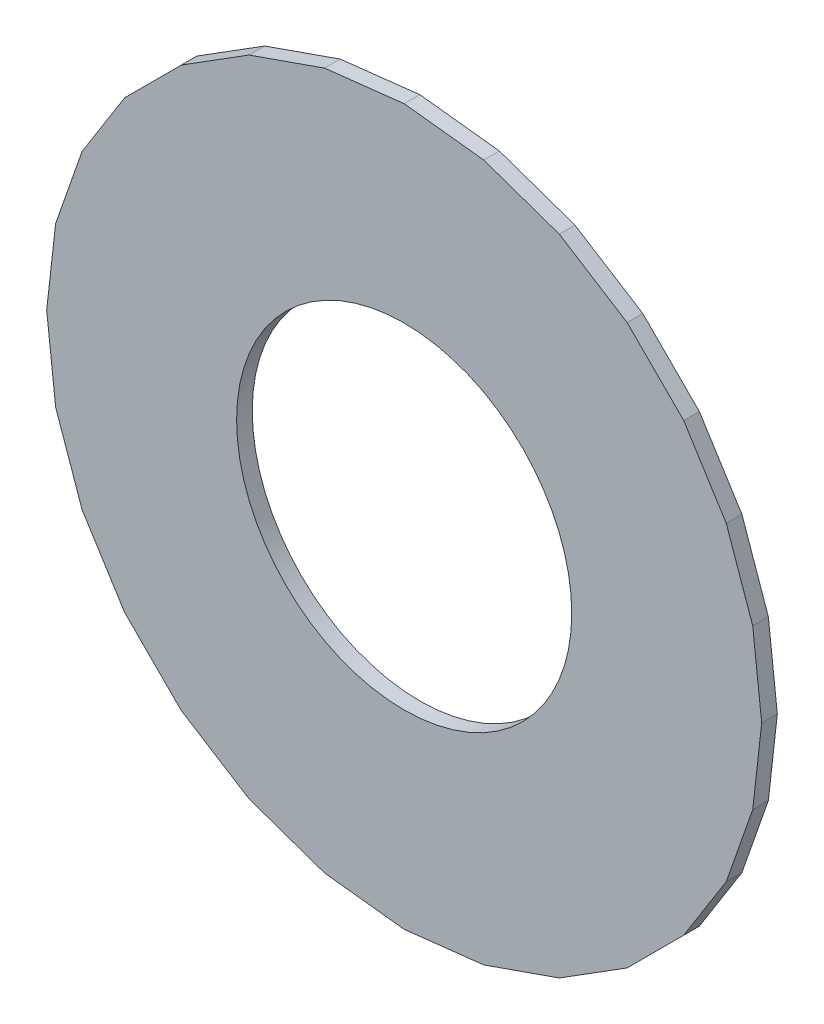
ISO-10303-21;
HEADER;
FILE_DESCRIPTION(('STEP AP214'),'2;1');
FILE_NAME('part.step','',(''),(''),'','','');
FILE_SCHEMA(('AUTOMOTIVE_DESIGN { 1 0 10303 214 1 1 1 1 }'));
ENDSEC;
DATA;
#1=APPLICATION_CONTEXT('core data for automotive mechanical design processes');
#2=APPLICATION_PROTOCOL_DEFINITION('international standard','automotive_design',2000,#1);
#3=PRODUCT_CONTEXT('',#1,'mechanical');
#4=PRODUCT('Part','Part','',(#3));
#5=PRODUCT_RELATED_PRODUCT_CATEGORY('part','',(#4));
#6=PRODUCT_DEFINITION_FORMATION('','',#4);
#7=PRODUCT_DEFINITION_CONTEXT('part definition',#1,'design');
#8=PRODUCT_DEFINITION('design','',#6,#7);
#9=PRODUCT_DEFINITION_SHAPE('','',#8);
#10=(LENGTH_UNIT() NAMED_UNIT(*) SI_UNIT(.MILLI.,.METRE.));
#11=(NAMED_UNIT(*) PLANE_ANGLE_UNIT() SI_UNIT($,.RADIAN.));
#12=(NAMED_UNIT(*) SI_UNIT($,.STERADIAN.) SOLID_ANGLE_UNIT());
#13=UNCERTAINTY_MEASURE_WITH_UNIT(LENGTH_MEASURE(1.E-05),#10,'distance_accuracy_value','');
#14=(GEOMETRIC_REPRESENTATION_CONTEXT(3) GLOBAL_UNCERTAINTY_ASSIGNED_CONTEXT((#13)) GLOBAL_UNIT_ASSIGNED_CONTEXT((#10,
#11,#12)) REPRESENTATION_CONTEXT('',''));
#15=CARTESIAN_POINT('',(0.,0.,0.));
#16=DIRECTION('',(0.,0.,1.));
#17=DIRECTION('',(1.,0.,0.));
#18=AXIS2_PLACEMENT_3D('',#15,#16,#17);
#19=CARTESIAN_POINT('',(165.608,-72.644,-0.045));
#20=DIRECTION('',(0.,0.,-1.));
#21=DIRECTION('',(0.,-1.,0.));
#22=AXIS2_PLACEMENT_3D('',#19,#20,#21);
#23=CYLINDRICAL_SURFACE('',#22,0.375);
#24=CARTESIAN_POINT('',(165.608,-72.644,-0.035));
#25=DIRECTION('',(0.,0.,-1.));
#26=DIRECTION('',(0.,-1.,0.));
#27=AXIS2_PLACEMENT_3D('',#24,#25,#26);
#28=CIRCLE('',#27,0.375);
#29=CARTESIAN_POINT('',(165.608,-73.019,-0.035));
#30=VERTEX_POINT('',#29);
#31=EDGE_CURVE('E222',#30,#30,#28,.T.);
#32=ORIENTED_EDGE('',*,*,#31,.T.);
#33=DIRECTION('',(0.,0.,1.));
#34=VECTOR('',#33,1.);
#35=CARTESIAN_POINT('',(165.608,-73.019,-0.045));
#36=LINE('',#35,#34);
#37=CARTESIAN_POINT('',(165.608,-73.019,0.));
#38=VERTEX_POINT('',#37);
#39=EDGE_CURVE('E11',#30,#38,#36,.T.);
#40=ORIENTED_EDGE('',*,*,#39,.T.);
#41=CARTESIAN_POINT('',(165.608,-72.644,0.));
#42=DIRECTION('',(0.,0.,-1.));
#43=DIRECTION('',(0.,-1.,0.));
#44=AXIS2_PLACEMENT_3D('',#41,#42,#43);
#45=CIRCLE('',#44,0.375);
#46=EDGE_CURVE('E167',#38,#38,#45,.T.);
#47=ORIENTED_EDGE('',*,*,#46,.F.);
#48=ORIENTED_EDGE('',*,*,#39,.F.);
#49=EDGE_LOOP('',(#32,#40,#47,#48));
#50=FACE_BOUND('',#49,.T.);
#51=ADVANCED_FACE('F17',(#50),#23,.F.);
#52=CARTESIAN_POINT('',(165.429983,-73.423942,-0.035));
#53=DIRECTION('',(-0.330278315977918,-0.943883591336766,0.));
#54=DIRECTION('',(-0.943883591336766,0.330278315977918,0.));
#55=AXIS2_PLACEMENT_3D('',#52,#53,#54);
#56=PLANE('',#55);
#57=DIRECTION('',(0.,0.,1.));
#58=VECTOR('',#57,1.);
#59=CARTESIAN_POINT('',(165.429983,-73.423942,-0.035));
#60=LINE('',#59,#58);
#61=CARTESIAN_POINT('',(165.429983,-73.423942,-0.035));
#62=VERTEX_POINT('',#61);
#63=CARTESIAN_POINT('',(165.429983,-73.423942,0.));
#64=VERTEX_POINT('',#63);
#65=EDGE_CURVE('E25',#62,#64,#60,.T.);
#66=ORIENTED_EDGE('',*,*,#65,.T.);
#67=DIRECTION('',(-0.943883591336766,0.330278315977918,0.));
#68=VECTOR('',#67,1.);
#69=CARTESIAN_POINT('',(165.429983,-73.423942,0.));
#70=LINE('',#69,#68);
#71=CARTESIAN_POINT('',(165.260893,-73.364775,0.));
#72=VERTEX_POINT('',#71);
#73=EDGE_CURVE('E131',#64,#72,#70,.T.);
#74=ORIENTED_EDGE('',*,*,#73,.T.);
#75=DIRECTION('',(0.,0.,1.));
#76=VECTOR('',#75,1.);
#77=CARTESIAN_POINT('',(165.260893,-73.364775,-0.035));
#78=LINE('',#77,#76);
#79=CARTESIAN_POINT('',(165.260893,-73.364775,-0.035));
#80=VERTEX_POINT('',#79);
#81=EDGE_CURVE('E136',#80,#72,#78,.T.);
#82=ORIENTED_EDGE('',*,*,#81,.F.);
#83=DIRECTION('',(-0.943883591336766,0.330278315977918,0.));
#84=VECTOR('',#83,1.);
#85=CARTESIAN_POINT('',(165.429983,-73.423942,-0.035));
#86=LINE('',#85,#84);
#87=EDGE_CURVE('E440',#62,#80,#86,.T.);
#88=ORIENTED_EDGE('',*,*,#87,.F.);
#89=EDGE_LOOP('',(#66,#74,#82,#88));
#90=FACE_BOUND('',#89,.T.);
#91=ADVANCED_FACE('F659',(#90),#56,.T.);
#92=CARTESIAN_POINT('',(165.608,-73.444,-0.035));
#93=DIRECTION('',(-0.111966136678988,-0.993712022789894,0.));
#94=DIRECTION('',(-0.993712022789894,0.111966136678988,0.));
#95=AXIS2_PLACEMENT_3D('',#92,#93,#94);
#96=PLANE('',#95);
#97=DIRECTION('',(0.,0.,1.));
#98=VECTOR('',#97,1.);
#99=CARTESIAN_POINT('',(165.608,-73.444,-0.035));
#100=LINE('',#99,#98);
#101=CARTESIAN_POINT('',(165.608,-73.444,-0.035));
#102=VERTEX_POINT('',#101);
#103=CARTESIAN_POINT('',(165.608,-73.444,0.));
#104=VERTEX_POINT('',#103);
#105=EDGE_CURVE('E132',#102,#104,#100,.T.);
#106=ORIENTED_EDGE('',*,*,#105,.T.);
#107=DIRECTION('',(-0.993712022789894,0.111966136678988,0.));
#108=VECTOR('',#107,1.);
#109=CARTESIAN_POINT('',(165.608,-73.444,0.));
#110=LINE('',#109,#108);
#111=EDGE_CURVE('E142',#104,#64,#110,.T.);
#112=ORIENTED_EDGE('',*,*,#111,.T.);
#113=ORIENTED_EDGE('',*,*,#65,.F.);
#114=DIRECTION('',(-0.993712022789894,0.111966136678988,0.));
#115=VECTOR('',#114,1.);
#116=CARTESIAN_POINT('',(165.608,-73.444,-0.035));
#117=LINE('',#116,#115);
#118=EDGE_CURVE('E436',#102,#62,#117,.T.);
#119=ORIENTED_EDGE('',*,*,#118,.F.);
#120=EDGE_LOOP('',(#106,#112,#113,#119));
#121=FACE_BOUND('',#120,.T.);
#122=ADVANCED_FACE('F664',(#121),#96,.T.);
#123=CARTESIAN_POINT('',(165.260893,-73.364775,-0.035));
#124=DIRECTION('',(-0.532032066600227,-0.846724205458361,0.));
#125=DIRECTION('',(-0.846724205458361,0.532032066600227,0.));
#126=AXIS2_PLACEMENT_3D('',#123,#124,#125);
#127=PLANE('',#126);
#128=ORIENTED_EDGE('',*,*,#81,.T.);
#129=DIRECTION('',(-0.846724205458361,0.532032066600227,0.));
#130=VECTOR('',#129,1.);
#131=CARTESIAN_POINT('',(165.260893,-73.364775,0.));
#132=LINE('',#131,#130);
#133=CARTESIAN_POINT('',(165.109208,-73.269465,0.));
#134=VERTEX_POINT('',#133);
#135=EDGE_CURVE('E127',#72,#134,#132,.T.);
#136=ORIENTED_EDGE('',*,*,#135,.T.);
#137=DIRECTION('',(0.,0.,1.));
#138=VECTOR('',#137,1.);
#139=CARTESIAN_POINT('',(165.109208,-73.269465,-0.035));
#140=LINE('',#139,#138);
#141=CARTESIAN_POINT('',(165.109208,-73.269465,-0.035));
#142=VERTEX_POINT('',#141);
#143=EDGE_CURVE('E137',#142,#134,#140,.T.);
#144=ORIENTED_EDGE('',*,*,#143,.F.);
#145=DIRECTION('',(-0.846724205458361,0.532032066600227,0.));
#146=VECTOR('',#145,1.);
#147=CARTESIAN_POINT('',(165.260893,-73.364775,-0.035));
#148=LINE('',#147,#146);
#149=EDGE_CURVE('E451',#80,#142,#148,.T.);
#150=ORIENTED_EDGE('',*,*,#149,.F.);
#151=EDGE_LOOP('',(#128,#136,#144,#150));
#152=FACE_BOUND('',#151,.T.);
#153=ADVANCED_FACE('F865',(#152),#127,.T.);
#154=CARTESIAN_POINT('',(165.786017,-73.423942,-0.035));
#155=DIRECTION('',(0.111966136678988,-0.993712022789894,0.));
#156=DIRECTION('',(0.,0.,-1.));
#157=AXIS2_PLACEMENT_3D('',#154,#155,#156);
#158=PLANE('',#157);
#159=DIRECTION('',(0.,0.,1.));
#160=VECTOR('',#159,1.);
#161=CARTESIAN_POINT('',(165.786017,-73.423942,-0.035));
#162=LINE('',#161,#160);
#163=CARTESIAN_POINT('',(165.786017,-73.423942,-0.035));
#164=VERTEX_POINT('',#163);
#165=CARTESIAN_POINT('',(165.786017,-73.423942,0.));
#166=VERTEX_POINT('',#165);
#167=EDGE_CURVE('E201',#164,#166,#162,.T.);
#168=ORIENTED_EDGE('',*,*,#167,.T.);
#169=DIRECTION('',(-0.993712022789894,-0.111966136678988,0.));
#170=VECTOR('',#169,1.);
#171=CARTESIAN_POINT('',(165.786017,-73.423942,0.));
#172=LINE('',#171,#170);
#173=EDGE_CURVE('E146',#166,#104,#172,.T.);
#174=ORIENTED_EDGE('',*,*,#173,.T.);
#175=ORIENTED_EDGE('',*,*,#105,.F.);
#176=DIRECTION('',(-0.993712022789894,-0.111966136678988,0.));
#177=VECTOR('',#176,1.);
#178=CARTESIAN_POINT('',(165.786017,-73.423942,-0.035));
#179=LINE('',#178,#177);
#180=EDGE_CURVE('E441',#164,#102,#179,.T.);
#181=ORIENTED_EDGE('',*,*,#180,.F.);
#182=EDGE_LOOP('',(#168,#174,#175,#181));
#183=FACE_BOUND('',#182,.T.);
#184=ADVANCED_FACE('F870',(#183),#158,.T.);
#185=CARTESIAN_POINT('',(165.109208,-73.269465,-0.035));
#186=DIRECTION('',(-0.707106781186548,-0.707106781186548,0.));
#187=DIRECTION('',(-0.707106781186548,0.707106781186548,0.));
#188=AXIS2_PLACEMENT_3D('',#185,#186,#187);
#189=PLANE('',#188);
#190=ORIENTED_EDGE('',*,*,#143,.T.);
#191=DIRECTION('',(-0.707106781186548,0.707106781186548,0.));
#192=VECTOR('',#191,1.);
#193=CARTESIAN_POINT('',(165.109208,-73.269465,0.));
#194=LINE('',#193,#192);
#195=CARTESIAN_POINT('',(164.982535,-73.142792,0.));
#196=VERTEX_POINT('',#195);
#197=EDGE_CURVE('E126',#134,#196,#194,.T.);
#198=ORIENTED_EDGE('',*,*,#197,.T.);
#199=DIRECTION('',(0.,0.,1.));
#200=VECTOR('',#199,1.);
#201=CARTESIAN_POINT('',(164.982535,-73.142792,-0.035));
#202=LINE('',#201,#200);
#203=CARTESIAN_POINT('',(164.982535,-73.142792,-0.035));
#204=VERTEX_POINT('',#203);
#205=EDGE_CURVE('E198',#204,#196,#202,.T.);
#206=ORIENTED_EDGE('',*,*,#205,.F.);
#207=DIRECTION('',(-0.707106781186548,0.707106781186548,0.));
#208=VECTOR('',#207,1.);
#209=CARTESIAN_POINT('',(165.109208,-73.269465,-0.035));
#210=LINE('',#209,#208);
#211=EDGE_CURVE('E455',#142,#204,#210,.T.);
#212=ORIENTED_EDGE('',*,*,#211,.F.);
#213=EDGE_LOOP('',(#190,#198,#206,#212));
#214=FACE_BOUND('',#213,.T.);
#215=ADVANCED_FACE('F509',(#214),#189,.T.);
#216=CARTESIAN_POINT('',(165.955107,-73.364775,-0.035));
#217=DIRECTION('',(0.330278315977027,-0.943883591337077,0.));
#218=DIRECTION('',(0.,0.,-1.));
#219=AXIS2_PLACEMENT_3D('',#216,#217,#218);
#220=PLANE('',#219);
#221=DIRECTION('',(0.,0.,1.));
#222=VECTOR('',#221,1.);
#223=CARTESIAN_POINT('',(165.955107,-73.364775,-0.035));
#224=LINE('',#223,#222);
#225=CARTESIAN_POINT('',(165.955107,-73.364775,-0.035));
#226=VERTEX_POINT('',#225);
#227=CARTESIAN_POINT('',(165.955107,-73.364775,0.));
#228=VERTEX_POINT('',#227);
#229=EDGE_CURVE('E194',#226,#228,#224,.T.);
#230=ORIENTED_EDGE('',*,*,#229,.T.);
#231=DIRECTION('',(-0.943883591337077,-0.330278315977027,0.));
#232=VECTOR('',#231,1.);
#233=CARTESIAN_POINT('',(165.955107,-73.364775,0.));
#234=LINE('',#233,#232);
#235=EDGE_CURVE('E150',#228,#166,#234,.T.);
#236=ORIENTED_EDGE('',*,*,#235,.T.);
#237=ORIENTED_EDGE('',*,*,#167,.F.);
#238=DIRECTION('',(-0.943883591337077,-0.330278315977027,0.));
#239=VECTOR('',#238,1.);
#240=CARTESIAN_POINT('',(165.955107,-73.364775,-0.035));
#241=LINE('',#240,#239);
#242=EDGE_CURVE('E435',#226,#164,#241,.T.);
#243=ORIENTED_EDGE('',*,*,#242,.F.);
#244=EDGE_LOOP('',(#230,#236,#237,#243));
#245=FACE_BOUND('',#244,.T.);
#246=ADVANCED_FACE('F1042',(#245),#220,.T.);
#247=CARTESIAN_POINT('',(164.982535,-73.142792,-0.035));
#248=DIRECTION('',(-0.846724205458361,-0.532032066600227,0.));
#249=DIRECTION('',(-0.532032066600227,0.846724205458361,0.));
#250=AXIS2_PLACEMENT_3D('',#247,#248,#249);
#251=PLANE('',#250);
#252=ORIENTED_EDGE('',*,*,#205,.T.);
#253=DIRECTION('',(-0.532032066600227,0.846724205458361,0.));
#254=VECTOR('',#253,1.);
#255=CARTESIAN_POINT('',(164.982535,-73.142792,0.));
#256=LINE('',#255,#254);
#257=CARTESIAN_POINT('',(164.887225,-72.991107,0.));
#258=VERTEX_POINT('',#257);
#259=EDGE_CURVE('E122',#196,#258,#256,.T.);
#260=ORIENTED_EDGE('',*,*,#259,.T.);
#261=DIRECTION('',(0.,0.,1.));
#262=VECTOR('',#261,1.);
#263=CARTESIAN_POINT('',(164.887225,-72.991107,-0.035));
#264=LINE('',#263,#262);
#265=CARTESIAN_POINT('',(164.887225,-72.991107,-0.035));
#266=VERTEX_POINT('',#265);
#267=EDGE_CURVE('E192',#266,#258,#264,.T.);
#268=ORIENTED_EDGE('',*,*,#267,.F.);
#269=DIRECTION('',(-0.532032066600227,0.846724205458361,0.));
#270=VECTOR('',#269,1.);
#271=CARTESIAN_POINT('',(164.982535,-73.142792,-0.035));
#272=LINE('',#271,#270);
#273=EDGE_CURVE('E458',#204,#266,#272,.T.);
#274=ORIENTED_EDGE('',*,*,#273,.F.);
#275=EDGE_LOOP('',(#252,#260,#268,#274));
#276=FACE_BOUND('',#275,.T.);
#277=ADVANCED_FACE('F517',(#276),#251,.T.);
#278=CARTESIAN_POINT('',(166.106792,-73.269465,-0.035));
#279=DIRECTION('',(0.532032066600227,-0.846724205458361,0.));
#280=DIRECTION('',(0.,0.,-1.));
#281=AXIS2_PLACEMENT_3D('',#278,#279,#280);
#282=PLANE('',#281);
#283=DIRECTION('',(0.,0.,1.));
#284=VECTOR('',#283,1.);
#285=CARTESIAN_POINT('',(166.106792,-73.269465,-0.035));
#286=LINE('',#285,#284);
#287=CARTESIAN_POINT('',(166.106792,-73.269465,-0.035));
#288=VERTEX_POINT('',#287);
#289=CARTESIAN_POINT('',(166.106792,-73.269465,0.));
#290=VERTEX_POINT('',#289);
#291=EDGE_CURVE('E188',#288,#290,#286,.T.);
#292=ORIENTED_EDGE('',*,*,#291,.T.);
#293=DIRECTION('',(-0.846724205458361,-0.532032066600227,0.));
#294=VECTOR('',#293,1.);
#295=CARTESIAN_POINT('',(166.106792,-73.269465,0.));
#296=LINE('',#295,#294);
#297=EDGE_CURVE('E154',#290,#228,#296,.T.);
#298=ORIENTED_EDGE('',*,*,#297,.T.);
#299=ORIENTED_EDGE('',*,*,#229,.F.);
#300=DIRECTION('',(-0.846724205458361,-0.532032066600227,0.));
#301=VECTOR('',#300,1.);
#302=CARTESIAN_POINT('',(166.106792,-73.269465,-0.035));
#303=LINE('',#302,#301);
#304=EDGE_CURVE('E431',#288,#226,#303,.T.);
#305=ORIENTED_EDGE('',*,*,#304,.F.);
#306=EDGE_LOOP('',(#292,#298,#299,#305));
#307=FACE_BOUND('',#306,.T.);
#308=ADVANCED_FACE('F1014',(#307),#282,.T.);
#309=CARTESIAN_POINT('',(164.887225,-72.991107,-0.035));
#310=DIRECTION('',(-0.943883591337077,-0.330278315977027,0.));
#311=DIRECTION('',(-0.330278315977027,0.943883591337077,0.));
#312=AXIS2_PLACEMENT_3D('',#309,#310,#311);
#313=PLANE('',#312);
#314=ORIENTED_EDGE('',*,*,#267,.T.);
#315=DIRECTION('',(-0.330278315977027,0.943883591337077,0.));
#316=VECTOR('',#315,1.);
#317=CARTESIAN_POINT('',(164.887225,-72.991107,0.));
#318=LINE('',#317,#316);
#319=CARTESIAN_POINT('',(164.828058,-72.822017,0.));
#320=VERTEX_POINT('',#319);
#321=EDGE_CURVE('E118',#258,#320,#318,.T.);
#322=ORIENTED_EDGE('',*,*,#321,.T.);
#323=DIRECTION('',(0.,0.,1.));
#324=VECTOR('',#323,1.);
#325=CARTESIAN_POINT('',(164.828058,-72.822017,-0.035));
#326=LINE('',#325,#324);
#327=CARTESIAN_POINT('',(164.828058,-72.822017,-0.035));
#328=VERTEX_POINT('',#327);
#329=EDGE_CURVE('E193',#328,#320,#326,.T.);
#330=ORIENTED_EDGE('',*,*,#329,.F.);
#331=DIRECTION('',(-0.330278315977027,0.943883591337077,0.));
#332=VECTOR('',#331,1.);
#333=CARTESIAN_POINT('',(164.887225,-72.991107,-0.035));
#334=LINE('',#333,#332);
#335=EDGE_CURVE('E463',#266,#328,#334,.T.);
#336=ORIENTED_EDGE('',*,*,#335,.F.);
#337=EDGE_LOOP('',(#314,#322,#330,#336));
#338=FACE_BOUND('',#337,.T.);
#339=ADVANCED_FACE('F1009',(#338),#313,.T.);
#340=CARTESIAN_POINT('',(166.233465,-73.142792,-0.035));
#341=DIRECTION('',(0.707106781186548,-0.707106781186548,0.));
#342=DIRECTION('',(0.,0.,-1.));
#343=AXIS2_PLACEMENT_3D('',#340,#341,#342);
#344=PLANE('',#343);
#345=DIRECTION('',(0.,0.,1.));
#346=VECTOR('',#345,1.);
#347=CARTESIAN_POINT('',(166.233465,-73.142792,-0.035));
#348=LINE('',#347,#346);
#349=CARTESIAN_POINT('',(166.233465,-73.142792,-0.035));
#350=VERTEX_POINT('',#349);
#351=CARTESIAN_POINT('',(166.233465,-73.142792,0.));
#352=VERTEX_POINT('',#351);
#353=EDGE_CURVE('E230',#350,#352,#348,.T.);
#354=ORIENTED_EDGE('',*,*,#353,.T.);
#355=DIRECTION('',(-0.707106781186548,-0.707106781186548,0.));
#356=VECTOR('',#355,1.);
#357=CARTESIAN_POINT('',(166.233465,-73.142792,0.));
#358=LINE('',#357,#356);
#359=EDGE_CURVE('E155',#352,#290,#358,.T.);
#360=ORIENTED_EDGE('',*,*,#359,.T.);
#361=ORIENTED_EDGE('',*,*,#291,.F.);
#362=DIRECTION('',(-0.707106781186548,-0.707106781186548,0.));
#363=VECTOR('',#362,1.);
#364=CARTESIAN_POINT('',(166.233465,-73.142792,-0.035));
#365=LINE('',#364,#363);
#366=EDGE_CURVE('E338',#350,#288,#365,.T.);
#367=ORIENTED_EDGE('',*,*,#366,.F.);
#368=EDGE_LOOP('',(#354,#360,#361,#367));
#369=FACE_BOUND('',#368,.T.);
#370=ADVANCED_FACE('F333',(#369),#344,.T.);
#371=CARTESIAN_POINT('',(164.828058,-72.822017,-0.035));
#372=DIRECTION('',(-0.993712022789894,-0.111966136678988,0.));
#373=DIRECTION('',(-0.111966136678988,0.993712022789894,0.));
#374=AXIS2_PLACEMENT_3D('',#371,#372,#373);
#375=PLANE('',#374);
#376=ORIENTED_EDGE('',*,*,#329,.T.);
#377=DIRECTION('',(-0.111966136678988,0.993712022789894,0.));
#378=VECTOR('',#377,1.);
#379=CARTESIAN_POINT('',(164.828058,-72.822017,0.));
#380=LINE('',#379,#378);
#381=CARTESIAN_POINT('',(164.808,-72.644,0.));
#382=VERTEX_POINT('',#381);
#383=EDGE_CURVE('E116',#320,#382,#380,.T.);
#384=ORIENTED_EDGE('',*,*,#383,.T.);
#385=DIRECTION('',(0.,0.,1.));
#386=VECTOR('',#385,1.);
#387=CARTESIAN_POINT('',(164.808,-72.644,-0.035));
#388=LINE('',#387,#386);
#389=CARTESIAN_POINT('',(164.808,-72.644,-0.035));
#390=VERTEX_POINT('',#389);
#391=EDGE_CURVE('E187',#390,#382,#388,.T.);
#392=ORIENTED_EDGE('',*,*,#391,.F.);
#393=DIRECTION('',(-0.111966136678988,0.993712022789894,0.));
#394=VECTOR('',#393,1.);
#395=CARTESIAN_POINT('',(164.828058,-72.822017,-0.035));
#396=LINE('',#395,#394);
#397=EDGE_CURVE('E467',#328,#390,#396,.T.);
#398=ORIENTED_EDGE('',*,*,#397,.F.);
#399=EDGE_LOOP('',(#376,#384,#392,#398));
#400=FACE_BOUND('',#399,.T.);
#401=ADVANCED_FACE('F263',(#400),#375,.T.);
#402=CARTESIAN_POINT('',(166.328775,-72.991107,-0.035));
#403=DIRECTION('',(0.846724205458361,-0.532032066600227,0.));
#404=DIRECTION('',(0.,0.,-1.));
#405=AXIS2_PLACEMENT_3D('',#402,#403,#404);
#406=PLANE('',#405);
#407=DIRECTION('',(0.,0.,1.));
#408=VECTOR('',#407,1.);
#409=CARTESIAN_POINT('',(166.328775,-72.991107,-0.035));
#410=LINE('',#409,#408);
#411=CARTESIAN_POINT('',(166.328775,-72.991107,-0.035));
#412=VERTEX_POINT('',#411);
#413=CARTESIAN_POINT('',(166.328775,-72.991107,0.));
#414=VERTEX_POINT('',#413);
#415=EDGE_CURVE('E184',#412,#414,#410,.T.);
#416=ORIENTED_EDGE('',*,*,#415,.T.);
#417=DIRECTION('',(-0.532032066600227,-0.846724205458361,0.));
#418=VECTOR('',#417,1.);
#419=CARTESIAN_POINT('',(166.328775,-72.991107,0.));
#420=LINE('',#419,#418);
#421=EDGE_CURVE('E159',#414,#352,#420,.T.);
#422=ORIENTED_EDGE('',*,*,#421,.T.);
#423=ORIENTED_EDGE('',*,*,#353,.F.);
#424=DIRECTION('',(-0.532032066600227,-0.846724205458361,0.));
#425=VECTOR('',#424,1.);
#426=CARTESIAN_POINT('',(166.328775,-72.991107,-0.035));
#427=LINE('',#426,#425);
#428=EDGE_CURVE('E418',#412,#350,#427,.T.);
#429=ORIENTED_EDGE('',*,*,#428,.F.);
#430=EDGE_LOOP('',(#416,#422,#423,#429));
#431=FACE_BOUND('',#430,.T.);
#432=ADVANCED_FACE('F343',(#431),#406,.T.);
#433=CARTESIAN_POINT('',(164.808,-72.644,-0.035));
#434=DIRECTION('',(-0.993712022789894,0.111966136678988,0.));
#435=DIRECTION('',(0.,0.,1.));
#436=AXIS2_PLACEMENT_3D('',#433,#434,#435);
#437=PLANE('',#436);
#438=ORIENTED_EDGE('',*,*,#391,.T.);
#439=DIRECTION('',(0.111966136678988,0.993712022789894,0.));
#440=VECTOR('',#439,1.);
#441=CARTESIAN_POINT('',(164.808,-72.644,0.));
#442=LINE('',#441,#440);
#443=CARTESIAN_POINT('',(164.828058,-72.465983,0.));
#444=VERTEX_POINT('',#443);
#445=EDGE_CURVE('E238',#382,#444,#442,.T.);
#446=ORIENTED_EDGE('',*,*,#445,.T.);
#447=DIRECTION('',(0.,0.,1.));
#448=VECTOR('',#447,1.);
#449=CARTESIAN_POINT('',(164.828058,-72.465983,-0.035));
#450=LINE('',#449,#448);
#451=CARTESIAN_POINT('',(164.828058,-72.465983,-0.035));
#452=VERTEX_POINT('',#451);
#453=EDGE_CURVE('E183',#452,#444,#450,.T.);
#454=ORIENTED_EDGE('',*,*,#453,.F.);
#455=DIRECTION('',(0.111966136678988,0.993712022789894,0.));
#456=VECTOR('',#455,1.);
#457=CARTESIAN_POINT('',(164.808,-72.644,-0.035));
#458=LINE('',#457,#456);
#459=EDGE_CURVE('E473',#390,#452,#458,.T.);
#460=ORIENTED_EDGE('',*,*,#459,.F.);
#461=EDGE_LOOP('',(#438,#446,#454,#460));
#462=FACE_BOUND('',#461,.T.);
#463=ADVANCED_FACE('F997',(#462),#437,.T.);
#464=CARTESIAN_POINT('',(166.387942,-72.822017,-0.035));
#465=DIRECTION('',(0.943883591337077,-0.330278315977027,0.));
#466=DIRECTION('',(0.,0.,-1.));
#467=AXIS2_PLACEMENT_3D('',#464,#465,#466);
#468=PLANE('',#467);
#469=DIRECTION('',(0.,0.,1.));
#470=VECTOR('',#469,1.);
#471=CARTESIAN_POINT('',(166.387942,-72.822017,-0.035));
#472=LINE('',#471,#470);
#473=CARTESIAN_POINT('',(166.387942,-72.822017,-0.035));
#474=VERTEX_POINT('',#473);
#475=CARTESIAN_POINT('',(166.387942,-72.822017,0.));
#476=VERTEX_POINT('',#475);
#477=EDGE_CURVE('E180',#474,#476,#472,.T.);
#478=ORIENTED_EDGE('',*,*,#477,.T.);
#479=DIRECTION('',(-0.330278315977027,-0.943883591337077,0.));
#480=VECTOR('',#479,1.);
#481=CARTESIAN_POINT('',(166.387942,-72.822017,0.));
#482=LINE('',#481,#480);
#483=EDGE_CURVE('E112',#476,#414,#482,.T.);
#484=ORIENTED_EDGE('',*,*,#483,.T.);
#485=ORIENTED_EDGE('',*,*,#415,.F.);
#486=DIRECTION('',(-0.330278315977027,-0.943883591337077,0.));
#487=VECTOR('',#486,1.);
#488=CARTESIAN_POINT('',(166.387942,-72.822017,-0.035));
#489=LINE('',#488,#487);
#490=EDGE_CURVE('E403',#474,#412,#489,.T.);
#491=ORIENTED_EDGE('',*,*,#490,.F.);
#492=EDGE_LOOP('',(#478,#484,#485,#491));
#493=FACE_BOUND('',#492,.T.);
#494=ADVANCED_FACE('F963',(#493),#468,.T.);
#495=CARTESIAN_POINT('',(164.828058,-72.465983,-0.035));
#496=DIRECTION('',(-0.943883591337077,0.330278315977027,0.));
#497=DIRECTION('',(0.,0.,1.));
#498=AXIS2_PLACEMENT_3D('',#495,#496,#497);
#499=PLANE('',#498);
#500=ORIENTED_EDGE('',*,*,#453,.T.);
#501=DIRECTION('',(0.330278315977027,0.943883591337077,0.));
#502=VECTOR('',#501,1.);
#503=CARTESIAN_POINT('',(164.828058,-72.465983,0.));
#504=LINE('',#503,#502);
#505=CARTESIAN_POINT('',(164.887225,-72.296893,0.));
#506=VERTEX_POINT('',#505);
#507=EDGE_CURVE('E234',#444,#506,#504,.T.);
#508=ORIENTED_EDGE('',*,*,#507,.T.);
#509=DIRECTION('',(0.,0.,1.));
#510=VECTOR('',#509,1.);
#511=CARTESIAN_POINT('',(164.887225,-72.296893,-0.035));
#512=LINE('',#511,#510);
#513=CARTESIAN_POINT('',(164.887225,-72.296893,-0.035));
#514=VERTEX_POINT('',#513);
#515=EDGE_CURVE('E179',#514,#506,#512,.T.);
#516=ORIENTED_EDGE('',*,*,#515,.F.);
#517=DIRECTION('',(0.330278315977027,0.943883591337077,0.));
#518=VECTOR('',#517,1.);
#519=CARTESIAN_POINT('',(164.828058,-72.465983,-0.035));
#520=LINE('',#519,#518);
#521=EDGE_CURVE('E428',#452,#514,#520,.T.);
#522=ORIENTED_EDGE('',*,*,#521,.F.);
#523=EDGE_LOOP('',(#500,#508,#516,#522));
#524=FACE_BOUND('',#523,.T.);
#525=ADVANCED_FACE('F281',(#524),#499,.T.);
#526=CARTESIAN_POINT('',(166.408,-72.644,-0.035));
#527=DIRECTION('',(0.993712022789894,-0.111966136678988,0.));
#528=DIRECTION('',(0.,0.,-1.));
#529=AXIS2_PLACEMENT_3D('',#526,#527,#528);
#530=PLANE('',#529);
#531=DIRECTION('',(0.,0.,1.));
#532=VECTOR('',#531,1.);
#533=CARTESIAN_POINT('',(166.408,-72.644,-0.035));
#534=LINE('',#533,#532);
#535=CARTESIAN_POINT('',(166.408,-72.644,-0.035));
#536=VERTEX_POINT('',#535);
#537=CARTESIAN_POINT('',(166.408,-72.644,0.));
#538=VERTEX_POINT('',#537);
#539=EDGE_CURVE('E141',#536,#538,#534,.T.);
#540=ORIENTED_EDGE('',*,*,#539,.T.);
#541=DIRECTION('',(-0.111966136678988,-0.993712022789894,0.));
#542=VECTOR('',#541,1.);
#543=CARTESIAN_POINT('',(166.408,-72.644,0.));
#544=LINE('',#543,#542);
#545=EDGE_CURVE('E105',#538,#476,#544,.T.);
#546=ORIENTED_EDGE('',*,*,#545,.T.);
#547=ORIENTED_EDGE('',*,*,#477,.F.);
#548=DIRECTION('',(-0.111966136678988,-0.993712022789894,0.));
#549=VECTOR('',#548,1.);
#550=CARTESIAN_POINT('',(166.408,-72.644,-0.035));
#551=LINE('',#550,#549);
#552=EDGE_CURVE('E399',#536,#474,#551,.T.);
#553=ORIENTED_EDGE('',*,*,#552,.F.);
#554=EDGE_LOOP('',(#540,#546,#547,#553));
#555=FACE_BOUND('',#554,.T.);
#556=ADVANCED_FACE('F646',(#555),#530,.T.);
#557=CARTESIAN_POINT('',(164.887225,-72.296893,-0.035));
#558=DIRECTION('',(-0.846724205458361,0.532032066600227,0.));
#559=DIRECTION('',(0.,0.,1.));
#560=AXIS2_PLACEMENT_3D('',#557,#558,#559);
#561=PLANE('',#560);
#562=ORIENTED_EDGE('',*,*,#515,.T.);
#563=DIRECTION('',(0.532032066600227,0.846724205458361,0.));
#564=VECTOR('',#563,1.);
#565=CARTESIAN_POINT('',(164.887225,-72.296893,0.));
#566=LINE('',#565,#564);
#567=CARTESIAN_POINT('',(164.982535,-72.145208,0.));
#568=VERTEX_POINT('',#567);
#569=EDGE_CURVE('E239',#506,#568,#566,.T.);
#570=ORIENTED_EDGE('',*,*,#569,.T.);
#571=DIRECTION('',(0.,0.,1.));
#572=VECTOR('',#571,1.);
#573=CARTESIAN_POINT('',(164.982535,-72.145208,-0.035));
#574=LINE('',#573,#572);
#575=CARTESIAN_POINT('',(164.982535,-72.145208,-0.035));
#576=VERTEX_POINT('',#575);
#577=EDGE_CURVE('E88',#576,#568,#574,.T.);
#578=ORIENTED_EDGE('',*,*,#577,.F.);
#579=DIRECTION('',(0.532032066600227,0.846724205458361,0.));
#580=VECTOR('',#579,1.);
#581=CARTESIAN_POINT('',(164.887225,-72.296893,-0.035));
#582=LINE('',#581,#580);
#583=EDGE_CURVE('E423',#514,#576,#582,.T.);
#584=ORIENTED_EDGE('',*,*,#583,.F.);
#585=EDGE_LOOP('',(#562,#570,#578,#584));
#586=FACE_BOUND('',#585,.T.);
#587=ADVANCED_FACE('F644',(#586),#561,.T.);
#588=CARTESIAN_POINT('',(166.387942,-72.465983,-0.035));
#589=DIRECTION('',(0.993712022789894,0.111966136678988,0.));
#590=DIRECTION('',(0.,0.,-1.));
#591=AXIS2_PLACEMENT_3D('',#588,#589,#590);
#592=PLANE('',#591);
#593=DIRECTION('',(0.,0.,1.));
#594=VECTOR('',#593,1.);
#595=CARTESIAN_POINT('',(166.387942,-72.465983,-0.035));
#596=LINE('',#595,#594);
#597=CARTESIAN_POINT('',(166.387942,-72.465983,-0.035));
#598=VERTEX_POINT('',#597);
#599=CARTESIAN_POINT('',(166.387942,-72.465983,0.));
#600=VERTEX_POINT('',#599);
#601=EDGE_CURVE('E74',#598,#600,#596,.T.);
#602=ORIENTED_EDGE('',*,*,#601,.T.);
#603=DIRECTION('',(0.111966136678988,-0.993712022789894,0.));
#604=VECTOR('',#603,1.);
#605=CARTESIAN_POINT('',(166.387942,-72.465983,0.));
#606=LINE('',#605,#604);
#607=EDGE_CURVE('E79',#600,#538,#606,.T.);
#608=ORIENTED_EDGE('',*,*,#607,.T.);
#609=ORIENTED_EDGE('',*,*,#539,.F.);
#610=DIRECTION('',(0.111966136678988,-0.993712022789894,0.));
#611=VECTOR('',#610,1.);
#612=CARTESIAN_POINT('',(166.387942,-72.465983,-0.035));
#613=LINE('',#612,#611);
#614=EDGE_CURVE('E83',#598,#536,#613,.T.);
#615=ORIENTED_EDGE('',*,*,#614,.F.);
#616=EDGE_LOOP('',(#602,#608,#609,#615));
#617=FACE_BOUND('',#616,.T.);
#618=ADVANCED_FACE('F76',(#617),#592,.T.);
#619=CARTESIAN_POINT('',(164.982535,-72.145208,-0.035));
#620=DIRECTION('',(-0.707106781186548,0.707106781186548,0.));
#621=DIRECTION('',(0.,0.,1.));
#622=AXIS2_PLACEMENT_3D('',#619,#620,#621);
#623=PLANE('',#622);
#624=ORIENTED_EDGE('',*,*,#577,.T.);
#625=DIRECTION('',(0.707106781186548,0.707106781186548,0.));
#626=VECTOR('',#625,1.);
#627=CARTESIAN_POINT('',(164.982535,-72.145208,0.));
#628=LINE('',#627,#626);
#629=CARTESIAN_POINT('',(165.109208,-72.018535,0.));
#630=VERTEX_POINT('',#629);
#631=EDGE_CURVE('E411',#568,#630,#628,.T.);
#632=ORIENTED_EDGE('',*,*,#631,.T.);
#633=DIRECTION('',(0.,0.,1.));
#634=VECTOR('',#633,1.);
#635=CARTESIAN_POINT('',(165.109208,-72.018535,-0.035));
#636=LINE('',#635,#634);
#637=CARTESIAN_POINT('',(165.109208,-72.018535,-0.035));
#638=VERTEX_POINT('',#637);
#639=EDGE_CURVE('E89',#638,#630,#636,.T.);
#640=ORIENTED_EDGE('',*,*,#639,.F.);
#641=DIRECTION('',(0.707106781186548,0.707106781186548,0.));
#642=VECTOR('',#641,1.);
#643=CARTESIAN_POINT('',(164.982535,-72.145208,-0.035));
#644=LINE('',#643,#642);
#645=EDGE_CURVE('E427',#576,#638,#644,.T.);
#646=ORIENTED_EDGE('',*,*,#645,.F.);
#647=EDGE_LOOP('',(#624,#632,#640,#646));
#648=FACE_BOUND('',#647,.T.);
#649=ADVANCED_FACE('F637',(#648),#623,.T.);
#650=CARTESIAN_POINT('',(166.328775,-72.296893,-0.035));
#651=DIRECTION('',(0.943883591337077,0.330278315977027,0.));
#652=DIRECTION('',(0.,0.,-1.));
#653=AXIS2_PLACEMENT_3D('',#650,#651,#652);
#654=PLANE('',#653);
#655=DIRECTION('',(0.,0.,1.));
#656=VECTOR('',#655,1.);
#657=CARTESIAN_POINT('',(166.328775,-72.296893,-0.035));
#658=LINE('',#657,#656);
#659=CARTESIAN_POINT('',(166.328775,-72.296893,-0.035));
#660=VERTEX_POINT('',#659);
#661=CARTESIAN_POINT('',(166.328775,-72.296893,0.));
#662=VERTEX_POINT('',#661);
#663=EDGE_CURVE('E95',#660,#662,#658,.T.);
#664=ORIENTED_EDGE('',*,*,#663,.T.);
#665=DIRECTION('',(0.330278315977027,-0.943883591337077,0.));
#666=VECTOR('',#665,1.);
#667=CARTESIAN_POINT('',(166.328775,-72.296893,0.));
#668=LINE('',#667,#666);
#669=EDGE_CURVE('E92',#662,#600,#668,.T.);
#670=ORIENTED_EDGE('',*,*,#669,.T.);
#671=ORIENTED_EDGE('',*,*,#601,.F.);
#672=DIRECTION('',(0.330278315977027,-0.943883591337077,0.));
#673=VECTOR('',#672,1.);
#674=CARTESIAN_POINT('',(166.328775,-72.296893,-0.035));
#675=LINE('',#674,#673);
#676=EDGE_CURVE('E410',#660,#598,#675,.T.);
#677=ORIENTED_EDGE('',*,*,#676,.F.);
#678=EDGE_LOOP('',(#664,#670,#671,#677));
#679=FACE_BOUND('',#678,.T.);
#680=ADVANCED_FACE('F93',(#679),#654,.T.);
#681=CARTESIAN_POINT('',(165.109208,-72.018535,-0.035));
#682=DIRECTION('',(-0.532032066600227,0.846724205458361,0.));
#683=DIRECTION('',(0.,0.,1.));
#684=AXIS2_PLACEMENT_3D('',#681,#682,#683);
#685=PLANE('',#684);
#686=ORIENTED_EDGE('',*,*,#639,.T.);
#687=DIRECTION('',(0.846724205458361,0.532032066600227,0.));
#688=VECTOR('',#687,1.);
#689=CARTESIAN_POINT('',(165.109208,-72.018535,0.));
#690=LINE('',#689,#688);
#691=CARTESIAN_POINT('',(165.260893,-71.923225,0.));
#692=VERTEX_POINT('',#691);
#693=EDGE_CURVE('E228',#630,#692,#690,.T.);
#694=ORIENTED_EDGE('',*,*,#693,.T.);
#695=DIRECTION('',(0.,0.,1.));
#696=VECTOR('',#695,1.);
#697=CARTESIAN_POINT('',(165.260893,-71.923225,-0.035));
#698=LINE('',#697,#696);
#699=CARTESIAN_POINT('',(165.260893,-71.923225,-0.035));
#700=VERTEX_POINT('',#699);
#701=EDGE_CURVE('E170',#700,#692,#698,.T.);
#702=ORIENTED_EDGE('',*,*,#701,.F.);
#703=DIRECTION('',(0.846724205458361,0.532032066600227,0.));
#704=VECTOR('',#703,1.);
#705=CARTESIAN_POINT('',(165.109208,-72.018535,-0.035));
#706=LINE('',#705,#704);
#707=EDGE_CURVE('E486',#638,#700,#706,.T.);
#708=ORIENTED_EDGE('',*,*,#707,.F.);
#709=EDGE_LOOP('',(#686,#694,#702,#708));
#710=FACE_BOUND('',#709,.T.);
#711=ADVANCED_FACE('F632',(#710),#685,.T.);
#712=CARTESIAN_POINT('',(166.233465,-72.145208,-0.035));
#713=DIRECTION('',(0.846724205458361,0.532032066600227,0.));
#714=DIRECTION('',(0.,0.,-1.));
#715=AXIS2_PLACEMENT_3D('',#712,#713,#714);
#716=PLANE('',#715);
#717=DIRECTION('',(0.,0.,1.));
#718=VECTOR('',#717,1.);
#719=CARTESIAN_POINT('',(166.233465,-72.145208,-0.035));
#720=LINE('',#719,#718);
#721=CARTESIAN_POINT('',(166.233465,-72.145208,-0.035));
#722=VERTEX_POINT('',#721);
#723=CARTESIAN_POINT('',(166.233465,-72.145208,0.));
#724=VERTEX_POINT('',#723);
#725=EDGE_CURVE('E48',#722,#724,#720,.T.);
#726=ORIENTED_EDGE('',*,*,#725,.T.);
#727=DIRECTION('',(0.532032066600227,-0.846724205458361,0.));
#728=VECTOR('',#727,1.);
#729=CARTESIAN_POINT('',(166.233465,-72.145208,0.));
#730=LINE('',#729,#728);
#731=EDGE_CURVE('E99',#724,#662,#730,.T.);
#732=ORIENTED_EDGE('',*,*,#731,.T.);
#733=ORIENTED_EDGE('',*,*,#663,.F.);
#734=DIRECTION('',(0.532032066600227,-0.846724205458361,0.));
#735=VECTOR('',#734,1.);
#736=CARTESIAN_POINT('',(166.233465,-72.145208,-0.035));
#737=LINE('',#736,#735);
#738=EDGE_CURVE('E407',#722,#660,#737,.T.);
#739=ORIENTED_EDGE('',*,*,#738,.F.);
#740=EDGE_LOOP('',(#726,#732,#733,#739));
#741=FACE_BOUND('',#740,.T.);
#742=ADVANCED_FACE('F547',(#741),#716,.T.);
#743=CARTESIAN_POINT('',(165.260893,-71.923225,-0.035));
#744=DIRECTION('',(-0.330278315977918,0.943883591336766,0.));
#745=DIRECTION('',(0.,0.,1.));
#746=AXIS2_PLACEMENT_3D('',#743,#744,#745);
#747=PLANE('',#746);
#748=ORIENTED_EDGE('',*,*,#701,.T.);
#749=DIRECTION('',(0.943883591336766,0.330278315977918,0.));
#750=VECTOR('',#749,1.);
#751=CARTESIAN_POINT('',(165.260893,-71.923225,0.));
#752=LINE('',#751,#750);
#753=CARTESIAN_POINT('',(165.429983,-71.864058,0.));
#754=VERTEX_POINT('',#753);
#755=EDGE_CURVE('E224',#692,#754,#752,.T.);
#756=ORIENTED_EDGE('',*,*,#755,.T.);
#757=DIRECTION('',(0.,0.,1.));
#758=VECTOR('',#757,1.);
#759=CARTESIAN_POINT('',(165.429983,-71.864058,-0.035));
#760=LINE('',#759,#758);
#761=CARTESIAN_POINT('',(165.429983,-71.864058,-0.035));
#762=VERTEX_POINT('',#761);
#763=EDGE_CURVE('E163',#762,#754,#760,.T.);
#764=ORIENTED_EDGE('',*,*,#763,.F.);
#765=DIRECTION('',(0.943883591336766,0.330278315977918,0.));
#766=VECTOR('',#765,1.);
#767=CARTESIAN_POINT('',(165.260893,-71.923225,-0.035));
#768=LINE('',#767,#766);
#769=EDGE_CURVE('E490',#700,#762,#768,.T.);
#770=ORIENTED_EDGE('',*,*,#769,.F.);
#771=EDGE_LOOP('',(#748,#756,#764,#770));
#772=FACE_BOUND('',#771,.T.);
#773=ADVANCED_FACE('F641',(#772),#747,.T.);
#774=CARTESIAN_POINT('',(166.106792,-72.018535,-0.035));
#775=DIRECTION('',(0.707106781186548,0.707106781186548,0.));
#776=DIRECTION('',(0.,0.,-1.));
#777=AXIS2_PLACEMENT_3D('',#774,#775,#776);
#778=PLANE('',#777);
#779=DIRECTION('',(0.,0.,1.));
#780=VECTOR('',#779,1.);
#781=CARTESIAN_POINT('',(166.106792,-72.018535,-0.035));
#782=LINE('',#781,#780);
#783=CARTESIAN_POINT('',(166.106792,-72.018535,-0.035));
#784=VERTEX_POINT('',#783);
#785=CARTESIAN_POINT('',(166.106792,-72.018535,0.));
#786=VERTEX_POINT('',#785);
#787=EDGE_CURVE('E379',#784,#786,#782,.T.);
#788=ORIENTED_EDGE('',*,*,#787,.T.);
#789=DIRECTION('',(0.707106781186548,-0.707106781186548,0.));
#790=VECTOR('',#789,1.);
#791=CARTESIAN_POINT('',(166.106792,-72.018535,0.));
#792=LINE('',#791,#790);
#793=EDGE_CURVE('E375',#786,#724,#792,.T.);
#794=ORIENTED_EDGE('',*,*,#793,.T.);
#795=ORIENTED_EDGE('',*,*,#725,.F.);
#796=DIRECTION('',(0.707106781186548,-0.707106781186548,0.));
#797=VECTOR('',#796,1.);
#798=CARTESIAN_POINT('',(166.106792,-72.018535,-0.035));
#799=LINE('',#798,#797);
#800=EDGE_CURVE('E398',#784,#722,#799,.T.);
#801=ORIENTED_EDGE('',*,*,#800,.F.);
#802=EDGE_LOOP('',(#788,#794,#795,#801));
#803=FACE_BOUND('',#802,.T.);
#804=ADVANCED_FACE('F941',(#803),#778,.T.);
#805=CARTESIAN_POINT('',(165.429983,-71.864058,-0.035));
#806=DIRECTION('',(-0.111966136678988,0.993712022789894,0.));
#807=DIRECTION('',(0.,0.,1.));
#808=AXIS2_PLACEMENT_3D('',#805,#806,#807);
#809=PLANE('',#808);
#810=ORIENTED_EDGE('',*,*,#763,.T.);
#811=DIRECTION('',(0.993712022789894,0.111966136678988,0.));
#812=VECTOR('',#811,1.);
#813=CARTESIAN_POINT('',(165.429983,-71.864058,0.));
#814=LINE('',#813,#812);
#815=CARTESIAN_POINT('',(165.608,-71.844,0.));
#816=VERTEX_POINT('',#815);
#817=EDGE_CURVE('E229',#754,#816,#814,.T.);
#818=ORIENTED_EDGE('',*,*,#817,.T.);
#819=DIRECTION('',(0.,0.,1.));
#820=VECTOR('',#819,1.);
#821=CARTESIAN_POINT('',(165.608,-71.844,-0.035));
#822=LINE('',#821,#820);
#823=CARTESIAN_POINT('',(165.608,-71.844,-0.035));
#824=VERTEX_POINT('',#823);
#825=EDGE_CURVE('E372',#824,#816,#822,.T.);
#826=ORIENTED_EDGE('',*,*,#825,.F.);
#827=DIRECTION('',(0.993712022789894,0.111966136678988,0.));
#828=VECTOR('',#827,1.);
#829=CARTESIAN_POINT('',(165.429983,-71.864058,-0.035));
#830=LINE('',#829,#828);
#831=EDGE_CURVE('E498',#762,#824,#830,.T.);
#832=ORIENTED_EDGE('',*,*,#831,.F.);
#833=EDGE_LOOP('',(#810,#818,#826,#832));
#834=FACE_BOUND('',#833,.T.);
#835=ADVANCED_FACE('F923',(#834),#809,.T.);
#836=CARTESIAN_POINT('',(0.,0.,0.));
#837=DIRECTION('',(0.,0.,1.));
#838=DIRECTION('',(1.,0.,0.));
#839=AXIS2_PLACEMENT_3D('',#836,#837,#838);
#840=PLANE('',#839);
#841=ORIENTED_EDGE('',*,*,#46,.T.);
#842=EDGE_LOOP('',(#841));
#843=FACE_BOUND('',#842,.T.);
#844=DIRECTION('',(0.943883591337077,-0.330278315977027,0.));
#845=VECTOR('',#844,1.);
#846=CARTESIAN_POINT('',(165.786017,-71.864058,0.));
#847=LINE('',#846,#845);
#848=CARTESIAN_POINT('',(165.786017,-71.864058,0.));
#849=VERTEX_POINT('',#848);
#850=CARTESIAN_POINT('',(165.955107,-71.923225,0.));
#851=VERTEX_POINT('',#850);
#852=EDGE_CURVE('E368',#849,#851,#847,.T.);
#853=ORIENTED_EDGE('',*,*,#852,.F.);
#854=DIRECTION('',(0.993712022789894,-0.111966136678988,0.));
#855=VECTOR('',#854,1.);
#856=CARTESIAN_POINT('',(165.608,-71.844,0.));
#857=LINE('',#856,#855);
#858=EDGE_CURVE('E362',#816,#849,#857,.T.);
#859=ORIENTED_EDGE('',*,*,#858,.F.);
#860=ORIENTED_EDGE('',*,*,#817,.F.);
#861=ORIENTED_EDGE('',*,*,#755,.F.);
#862=ORIENTED_EDGE('',*,*,#693,.F.);
#863=ORIENTED_EDGE('',*,*,#631,.F.);
#864=ORIENTED_EDGE('',*,*,#569,.F.);
#865=ORIENTED_EDGE('',*,*,#507,.F.);
#866=ORIENTED_EDGE('',*,*,#445,.F.);
#867=ORIENTED_EDGE('',*,*,#383,.F.);
#868=ORIENTED_EDGE('',*,*,#321,.F.);
#869=ORIENTED_EDGE('',*,*,#259,.F.);
#870=ORIENTED_EDGE('',*,*,#197,.F.);
#871=ORIENTED_EDGE('',*,*,#135,.F.);
#872=ORIENTED_EDGE('',*,*,#73,.F.);
#873=ORIENTED_EDGE('',*,*,#111,.F.);
#874=ORIENTED_EDGE('',*,*,#173,.F.);
#875=ORIENTED_EDGE('',*,*,#235,.F.);
#876=ORIENTED_EDGE('',*,*,#297,.F.);
#877=ORIENTED_EDGE('',*,*,#359,.F.);
#878=ORIENTED_EDGE('',*,*,#421,.F.);
#879=ORIENTED_EDGE('',*,*,#483,.F.);
#880=ORIENTED_EDGE('',*,*,#545,.F.);
#881=ORIENTED_EDGE('',*,*,#607,.F.);
#882=ORIENTED_EDGE('',*,*,#669,.F.);
#883=ORIENTED_EDGE('',*,*,#731,.F.);
#884=ORIENTED_EDGE('',*,*,#793,.F.);
#885=DIRECTION('',(0.846724205458361,-0.532032066600227,0.));
#886=VECTOR('',#885,1.);
#887=CARTESIAN_POINT('',(165.955107,-71.923225,0.));
#888=LINE('',#887,#886);
#889=EDGE_CURVE('E361',#851,#786,#888,.T.);
#890=ORIENTED_EDGE('',*,*,#889,.F.);
#891=EDGE_LOOP('',(#853,#859,#860,#861,#862,#863,#864,#865,#866,#867,#868,#869,#870,#871,#872,
#873,#874,#875,#876,#877,#878,#879,#880,#881,#882,#883,#884,#890));
#892=FACE_BOUND('',#891,.T.);
#893=ADVANCED_FACE('F102',(#843,#892),#840,.T.);
#894=CARTESIAN_POINT('',(0.,0.,-0.035));
#895=DIRECTION('',(0.,0.,1.));
#896=DIRECTION('',(1.,0.,0.));
#897=AXIS2_PLACEMENT_3D('',#894,#895,#896);
#898=PLANE('',#897);
#899=ORIENTED_EDGE('',*,*,#31,.F.);
#900=EDGE_LOOP('',(#899));
#901=FACE_BOUND('',#900,.T.);
#902=DIRECTION('',(0.846724205458361,-0.532032066600227,0.));
#903=VECTOR('',#902,1.);
#904=CARTESIAN_POINT('',(165.955107,-71.923225,-0.035));
#905=LINE('',#904,#903);
#906=CARTESIAN_POINT('',(165.955107,-71.923225,-0.035));
#907=VERTEX_POINT('',#906);
#908=EDGE_CURVE('E391',#907,#784,#905,.T.);
#909=ORIENTED_EDGE('',*,*,#908,.T.);
#910=ORIENTED_EDGE('',*,*,#800,.T.);
#911=ORIENTED_EDGE('',*,*,#738,.T.);
#912=ORIENTED_EDGE('',*,*,#676,.T.);
#913=ORIENTED_EDGE('',*,*,#614,.T.);
#914=ORIENTED_EDGE('',*,*,#552,.T.);
#915=ORIENTED_EDGE('',*,*,#490,.T.);
#916=ORIENTED_EDGE('',*,*,#428,.T.);
#917=ORIENTED_EDGE('',*,*,#366,.T.);
#918=ORIENTED_EDGE('',*,*,#304,.T.);
#919=ORIENTED_EDGE('',*,*,#242,.T.);
#920=ORIENTED_EDGE('',*,*,#180,.T.);
#921=ORIENTED_EDGE('',*,*,#118,.T.);
#922=ORIENTED_EDGE('',*,*,#87,.T.);
#923=ORIENTED_EDGE('',*,*,#149,.T.);
#924=ORIENTED_EDGE('',*,*,#211,.T.);
#925=ORIENTED_EDGE('',*,*,#273,.T.);
#926=ORIENTED_EDGE('',*,*,#335,.T.);
#927=ORIENTED_EDGE('',*,*,#397,.T.);
#928=ORIENTED_EDGE('',*,*,#459,.T.);
#929=ORIENTED_EDGE('',*,*,#521,.T.);
#930=ORIENTED_EDGE('',*,*,#583,.T.);
#931=ORIENTED_EDGE('',*,*,#645,.T.);
#932=ORIENTED_EDGE('',*,*,#707,.T.);
#933=ORIENTED_EDGE('',*,*,#769,.T.);
#934=ORIENTED_EDGE('',*,*,#831,.T.);
#935=DIRECTION('',(0.993712022789894,-0.111966136678988,0.));
#936=VECTOR('',#935,1.);
#937=CARTESIAN_POINT('',(165.608,-71.844,-0.035));
#938=LINE('',#937,#936);
#939=CARTESIAN_POINT('',(165.786017,-71.864058,-0.035));
#940=VERTEX_POINT('',#939);
#941=EDGE_CURVE('E357',#824,#940,#938,.T.);
#942=ORIENTED_EDGE('',*,*,#941,.T.);
#943=DIRECTION('',(0.943883591337077,-0.330278315977027,0.));
#944=VECTOR('',#943,1.);
#945=CARTESIAN_POINT('',(165.786017,-71.864058,-0.035));
#946=LINE('',#945,#944);
#947=EDGE_CURVE('E367',#940,#907,#946,.T.);
#948=ORIENTED_EDGE('',*,*,#947,.T.);
#949=EDGE_LOOP('',(#909,#910,#911,#912,#913,#914,#915,#916,#917,#918,#919,#920,#921,#922,#923,
#924,#925,#926,#927,#928,#929,#930,#931,#932,#933,#934,#942,#948));
#950=FACE_BOUND('',#949,.T.);
#951=ADVANCED_FACE('F542',(#901,#950),#898,.F.);
#952=CARTESIAN_POINT('',(165.955107,-71.923225,-0.035));
#953=DIRECTION('',(0.532032066600227,0.846724205458361,0.));
#954=DIRECTION('',(0.,0.,-1.));
#955=AXIS2_PLACEMENT_3D('',#952,#953,#954);
#956=PLANE('',#955);
#957=DIRECTION('',(0.,0.,1.));
#958=VECTOR('',#957,1.);
#959=CARTESIAN_POINT('',(165.955107,-71.923225,-0.035));
#960=LINE('',#959,#958);
#961=EDGE_CURVE('E363',#907,#851,#960,.T.);
#962=ORIENTED_EDGE('',*,*,#961,.T.);
#963=ORIENTED_EDGE('',*,*,#889,.T.);
#964=ORIENTED_EDGE('',*,*,#787,.F.);
#965=ORIENTED_EDGE('',*,*,#908,.F.);
#966=EDGE_LOOP('',(#962,#963,#964,#965));
#967=FACE_BOUND('',#966,.T.);
#968=ADVANCED_FACE('F853',(#967),#956,.T.);
#969=CARTESIAN_POINT('',(165.608,-71.844,-0.035));
#970=DIRECTION('',(0.111966136678988,0.993712022789894,0.));
#971=DIRECTION('',(0.,0.,-1.));
#972=AXIS2_PLACEMENT_3D('',#969,#970,#971);
#973=PLANE('',#972);
#974=ORIENTED_EDGE('',*,*,#825,.T.);
#975=ORIENTED_EDGE('',*,*,#858,.T.);
#976=DIRECTION('',(0.,0.,1.));
#977=VECTOR('',#976,1.);
#978=CARTESIAN_POINT('',(165.786017,-71.864058,-0.035));
#979=LINE('',#978,#977);
#980=EDGE_CURVE('E530',#940,#849,#979,.T.);
#981=ORIENTED_EDGE('',*,*,#980,.F.);
#982=ORIENTED_EDGE('',*,*,#941,.F.);
#983=EDGE_LOOP('',(#974,#975,#981,#982));
#984=FACE_BOUND('',#983,.T.);
#985=ADVANCED_FACE('F858',(#984),#973,.T.);
#986=CARTESIAN_POINT('',(165.786017,-71.864058,-0.035));
#987=DIRECTION('',(0.330278315977027,0.943883591337077,0.));
#988=DIRECTION('',(0.,0.,-1.));
#989=AXIS2_PLACEMENT_3D('',#986,#987,#988);
#990=PLANE('',#989);
#991=ORIENTED_EDGE('',*,*,#980,.T.);
#992=ORIENTED_EDGE('',*,*,#852,.T.);
#993=ORIENTED_EDGE('',*,*,#961,.F.);
#994=ORIENTED_EDGE('',*,*,#947,.F.);
#995=EDGE_LOOP('',(#991,#992,#993,#994));
#996=FACE_BOUND('',#995,.T.);
#997=ADVANCED_FACE('F876',(#996),#990,.T.);
#998=CLOSED_SHELL('',(#51,#91,#122,#153,#184,#215,#246,#277,#308,#339,#370,#401,#432,#463,#494,
#525,#556,#587,#618,#649,#680,#711,#742,#773,#804,#835,#893,#951,#968,#985,#997));
#999=MANIFOLD_SOLID_BREP('B1',#998);
#1000=ADVANCED_BREP_SHAPE_REPRESENTATION('',(#18,#999),#14);
#1001=SHAPE_DEFINITION_REPRESENTATION(#9,#1000);
ENDSEC;
END-ISO-10303-21;
